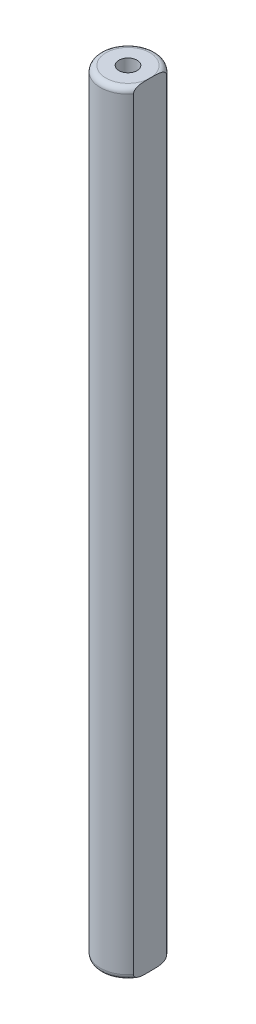
ISO-10303-21;
HEADER;
FILE_DESCRIPTION(('STEP AP214'),'2;1');
FILE_NAME('part.step','',(''),(''),'','','');
FILE_SCHEMA(('AUTOMOTIVE_DESIGN { 1 0 10303 214 1 1 1 1 }'));
ENDSEC;
DATA;
#1=APPLICATION_CONTEXT('core data for automotive mechanical design processes');
#2=APPLICATION_PROTOCOL_DEFINITION('international standard','automotive_design',2000,#1);
#3=PRODUCT_CONTEXT('',#1,'mechanical');
#4=PRODUCT('Part','Part','',(#3));
#5=PRODUCT_RELATED_PRODUCT_CATEGORY('part','',(#4));
#6=PRODUCT_DEFINITION_FORMATION('','',#4);
#7=PRODUCT_DEFINITION_CONTEXT('part definition',#1,'design');
#8=PRODUCT_DEFINITION('design','',#6,#7);
#9=PRODUCT_DEFINITION_SHAPE('','',#8);
#10=(LENGTH_UNIT() NAMED_UNIT(*) SI_UNIT(.MILLI.,.METRE.));
#11=(NAMED_UNIT(*) PLANE_ANGLE_UNIT() SI_UNIT($,.RADIAN.));
#12=(NAMED_UNIT(*) SI_UNIT($,.STERADIAN.) SOLID_ANGLE_UNIT());
#13=UNCERTAINTY_MEASURE_WITH_UNIT(LENGTH_MEASURE(1.E-05),#10,'distance_accuracy_value','');
#14=(GEOMETRIC_REPRESENTATION_CONTEXT(3) GLOBAL_UNCERTAINTY_ASSIGNED_CONTEXT((#13)) GLOBAL_UNIT_ASSIGNED_CONTEXT((#10,
#11,#12)) REPRESENTATION_CONTEXT('',''));
#15=CARTESIAN_POINT('',(0.,0.,0.));
#16=DIRECTION('',(0.,0.,1.));
#17=DIRECTION('',(1.,0.,0.));
#18=AXIS2_PLACEMENT_3D('',#15,#16,#17);
#19=CARTESIAN_POINT('',(0.,-35.15,0.));
#20=DIRECTION('',(0.,-1.,0.));
#21=DIRECTION('',(0.,0.,1.));
#22=AXIS2_PLACEMENT_3D('',#19,#20,#21);
#23=PLANE('',#22);
#24=CARTESIAN_POINT('',(0.,-35.15,0.));
#25=DIRECTION('',(0.,-1.,0.));
#26=DIRECTION('',(0.,0.,-1.));
#27=AXIS2_PLACEMENT_3D('',#24,#25,#26);
#28=CIRCLE('',#27,2.);
#29=CARTESIAN_POINT('',(2.,-35.15,0.));
#30=VERTEX_POINT('',#29);
#31=EDGE_CURVE('E11',#30,#30,#28,.T.);
#32=ORIENTED_EDGE('',*,*,#31,.T.);
#33=EDGE_LOOP('',(#32));
#34=FACE_BOUND('',#33,.T.);
#35=CARTESIAN_POINT('',(0.,-35.15,0.));
#36=DIRECTION('',(0.,1.,0.));
#37=DIRECTION('',(0.,0.,1.));
#38=AXIS2_PLACEMENT_3D('',#35,#36,#37);
#39=CIRCLE('',#38,0.825);
#40=CARTESIAN_POINT('',(0.,-35.15,0.825));
#41=VERTEX_POINT('',#40);
#42=EDGE_CURVE('E152',#41,#41,#39,.T.);
#43=ORIENTED_EDGE('',*,*,#42,.T.);
#44=EDGE_LOOP('',(#43));
#45=FACE_BOUND('',#44,.T.);
#46=ADVANCED_FACE('F38',(#34,#45),#23,.T.);
#47=CARTESIAN_POINT('',(0.,35.15,0.));
#48=DIRECTION('',(0.,-1.,0.));
#49=DIRECTION('',(0.,0.,-1.));
#50=AXIS2_PLACEMENT_3D('',#47,#48,#49);
#51=CYLINDRICAL_SURFACE('',#50,2.5);
#52=DIRECTION('',(0.,1.,0.));
#53=VECTOR('',#52,1.);
#54=CARTESIAN_POINT('',(2.,0.,-1.5));
#55=LINE('',#54,#53);
#56=CARTESIAN_POINT('',(2.,-34.65,-1.5));
#57=VERTEX_POINT('',#56);
#58=CARTESIAN_POINT('',(2.,34.65,-1.5));
#59=VERTEX_POINT('',#58);
#60=EDGE_CURVE('E89',#57,#59,#55,.T.);
#61=ORIENTED_EDGE('',*,*,#60,.F.);
#62=CARTESIAN_POINT('',(0.,-34.65,0.));
#63=DIRECTION('',(0.,-1.,0.));
#64=DIRECTION('',(0.,0.,-1.));
#65=AXIS2_PLACEMENT_3D('',#62,#63,#64);
#66=CIRCLE('',#65,2.5);
#67=CARTESIAN_POINT('',(2.,-34.65,1.5));
#68=VERTEX_POINT('',#67);
#69=EDGE_CURVE('E129',#57,#68,#66,.F.);
#70=ORIENTED_EDGE('',*,*,#69,.T.);
#71=DIRECTION('',(0.,1.,0.));
#72=VECTOR('',#71,1.);
#73=CARTESIAN_POINT('',(2.,0.,1.5));
#74=LINE('',#73,#72);
#75=CARTESIAN_POINT('',(2.,34.65,1.5));
#76=VERTEX_POINT('',#75);
#77=EDGE_CURVE('E137',#68,#76,#74,.T.);
#78=ORIENTED_EDGE('',*,*,#77,.T.);
#79=CARTESIAN_POINT('',(0.,34.65,0.));
#80=DIRECTION('',(0.,1.,0.));
#81=DIRECTION('',(0.,0.,1.));
#82=AXIS2_PLACEMENT_3D('',#79,#80,#81);
#83=CIRCLE('',#82,2.5);
#84=EDGE_CURVE('E84',#76,#59,#83,.F.);
#85=ORIENTED_EDGE('',*,*,#84,.T.);
#86=EDGE_LOOP('',(#61,#70,#78,#85));
#87=FACE_BOUND('',#86,.T.);
#88=ADVANCED_FACE('F172',(#87),#51,.T.);
#89=CARTESIAN_POINT('',(0.,35.15,0.));
#90=DIRECTION('',(0.,1.,0.));
#91=DIRECTION('',(0.,0.,1.));
#92=AXIS2_PLACEMENT_3D('',#89,#90,#91);
#93=PLANE('',#92);
#94=CARTESIAN_POINT('',(0.,35.15,0.));
#95=DIRECTION('',(0.,1.,0.));
#96=DIRECTION('',(0.,0.,1.));
#97=AXIS2_PLACEMENT_3D('',#94,#95,#96);
#98=CIRCLE('',#97,2.);
#99=CARTESIAN_POINT('',(2.,35.15,0.));
#100=VERTEX_POINT('',#99);
#101=EDGE_CURVE('E82',#100,#100,#98,.T.);
#102=ORIENTED_EDGE('',*,*,#101,.T.);
#103=EDGE_LOOP('',(#102));
#104=FACE_BOUND('',#103,.T.);
#105=CARTESIAN_POINT('',(0.,35.15,0.));
#106=DIRECTION('',(0.,1.,0.));
#107=DIRECTION('',(0.,0.,1.));
#108=AXIS2_PLACEMENT_3D('',#105,#106,#107);
#109=CIRCLE('',#108,0.825);
#110=CARTESIAN_POINT('',(0.,35.15,0.825));
#111=VERTEX_POINT('',#110);
#112=EDGE_CURVE('E97',#111,#111,#109,.T.);
#113=ORIENTED_EDGE('',*,*,#112,.F.);
#114=EDGE_LOOP('',(#113));
#115=FACE_BOUND('',#114,.T.);
#116=ADVANCED_FACE('F92',(#104,#115),#93,.T.);
#117=CARTESIAN_POINT('',(0.,30.15,0.));
#118=DIRECTION('',(0.,1.,0.));
#119=DIRECTION('',(0.,0.,1.));
#120=AXIS2_PLACEMENT_3D('',#117,#118,#119);
#121=CYLINDRICAL_SURFACE('',#120,0.825);
#122=CARTESIAN_POINT('',(0.,30.15,0.));
#123=DIRECTION('',(0.,1.,0.));
#124=DIRECTION('',(0.,0.,1.));
#125=AXIS2_PLACEMENT_3D('',#122,#123,#124);
#126=CIRCLE('',#125,0.825);
#127=CARTESIAN_POINT('',(0.,30.15,0.825));
#128=VERTEX_POINT('',#127);
#129=EDGE_CURVE('E94',#128,#128,#126,.T.);
#130=ORIENTED_EDGE('',*,*,#129,.F.);
#131=EDGE_LOOP('',(#130));
#132=FACE_BOUND('',#131,.T.);
#133=ORIENTED_EDGE('',*,*,#112,.T.);
#134=EDGE_LOOP('',(#133));
#135=FACE_BOUND('',#134,.T.);
#136=ADVANCED_FACE('F179',(#132,#135),#121,.F.);
#137=CARTESIAN_POINT('',(0.,30.15,0.));
#138=DIRECTION('',(0.,1.,0.));
#139=DIRECTION('',(0.,0.,1.));
#140=AXIS2_PLACEMENT_3D('',#137,#138,#139);
#141=PLANE('',#140);
#142=ORIENTED_EDGE('',*,*,#129,.T.);
#143=EDGE_LOOP('',(#142));
#144=FACE_BOUND('',#143,.T.);
#145=ADVANCED_FACE('F116',(#144),#141,.T.);
#146=CARTESIAN_POINT('',(2.,0.,-1.5));
#147=DIRECTION('',(-1.,0.,0.));
#148=DIRECTION('',(0.,0.,1.));
#149=AXIS2_PLACEMENT_3D('',#146,#147,#148);
#150=PLANE('',#149);
#151=ORIENTED_EDGE('',*,*,#77,.F.);
#152=CARTESIAN_POINT('',(2.,-34.65,1.5));
#153=CARTESIAN_POINT('',(2.,-34.6700065150284,1.50005508764518));
#154=CARTESIAN_POINT('',(2.,-34.6899505223803,1.49800297503595));
#155=CARTESIAN_POINT('',(2.,-34.7288908622129,1.49017103135305));
#156=CARTESIAN_POINT('',(2.,-34.747894786355,1.48442943896435));
#157=CARTESIAN_POINT('',(2.,-34.7845007170815,1.46971395516313));
#158=CARTESIAN_POINT('',(2.,-34.8021074472318,1.46075157527048));
#159=CARTESIAN_POINT('',(2.,-34.8357418270518,1.44018960181345));
#160=CARTESIAN_POINT('',(2.,-34.8517650844176,1.42858295243752));
#161=CARTESIAN_POINT('',(2.,-34.8889337995344,1.39760924057377));
#162=CARTESIAN_POINT('',(2.,-34.9091275913188,1.37710380043444));
#163=CARTESIAN_POINT('',(2.,-34.9460193785026,1.33321537886329));
#164=CARTESIAN_POINT('',(2.,-34.9627135559447,1.30982929844171));
#165=CARTESIAN_POINT('',(2.,-35.0025266059827,1.24588475655889));
#166=CARTESIAN_POINT('',(2.,-35.0231102761167,1.20375339504332));
#167=CARTESIAN_POINT('',(2.,-35.0492657628372,1.13857481760511));
#168=CARTESIAN_POINT('',(2.,-35.0572271665565,1.11639476146753));
#169=CARTESIAN_POINT('',(2.,-35.0717347834849,1.07158652733003));
#170=CARTESIAN_POINT('',(2.,-35.0782820228324,1.04895868735181));
#171=CARTESIAN_POINT('',(2.,-35.0954775535542,0.98298944776737));
#172=CARTESIAN_POINT('',(2.,-35.1045494991958,0.939240813702859));
#173=CARTESIAN_POINT('',(2.,-35.1194389319571,0.851180575194735));
#174=CARTESIAN_POINT('',(2.,-35.1252529100803,0.806868416119301));
#175=CARTESIAN_POINT('',(2.,-35.1345404183726,0.717748873858477));
#176=CARTESIAN_POINT('',(2.,-35.1380000262617,0.672940110398204));
#177=CARTESIAN_POINT('',(2.,-35.143276064899,0.583224127429965));
#178=CARTESIAN_POINT('',(2.,-35.1450920982067,0.538316886738996));
#179=CARTESIAN_POINT('',(2.,-35.1475884411658,0.452027170138225));
#180=CARTESIAN_POINT('',(2.,-35.148347176557,0.41064666147799));
#181=CARTESIAN_POINT('',(2.,-35.1493649293624,0.327877214900425));
#182=CARTESIAN_POINT('',(2.,-35.1496239046374,0.286488276566558));
#183=CARTESIAN_POINT('',(2.,-35.1499262759537,0.204245986253938));
#184=CARTESIAN_POINT('',(2.,-35.1499724201265,0.163392638975671));
#185=CARTESIAN_POINT('',(2.,-35.1499994454164,0.0816928216893207));
#186=CARTESIAN_POINT('',(2.,-35.1499803376138,0.0408463516913591));
#187=CARTESIAN_POINT('',(2.,-35.15,0.));
#188=B_SPLINE_CURVE_WITH_KNOTS('',3,(#152,#153,#154,#155,#156,#157,#158,#159,#160,#161,#162,
#163,#164,#165,#166,#167,#168,#169,#170,#171,#172,#173,#174,#175,#176,#177,#178,#179,#180,#181,
#182,#183,#184,#185,#186,#187),.UNSPECIFIED.,.F.,.F.,(4,2,2,2,2,2,2,2,2,2,2,2,2,2,2,2,2,4),(0.,
0.0598154823382621,0.119020807803601,0.17801659652445,0.237171689151991,0.323022405322572,
0.408966299732605,0.548800102010776,0.619474466309546,0.690097374684539,0.823948961414452,
0.957944437366622,1.09272554990604,1.22753924580545,1.35169671337952,1.47586464927865,
1.59842472260638,1.72096398530663),.UNSPECIFIED.);
#189=EDGE_CURVE('E48',#68,#30,#188,.T.);
#190=ORIENTED_EDGE('',*,*,#189,.T.);
#191=CARTESIAN_POINT('',(2.,-35.15,0.));
#192=CARTESIAN_POINT('',(2.,-35.149980484284,-0.0407626231076274));
#193=CARTESIAN_POINT('',(2.,-35.1499994433899,-0.0815253750922536));
#194=CARTESIAN_POINT('',(2.,-35.1499726519699,-0.163057529759016));
#195=CARTESIAN_POINT('',(2.,-35.1499268907924,-0.203826932431483));
#196=CARTESIAN_POINT('',(2.,-35.1496272394696,-0.285823216792322));
#197=CARTESIAN_POINT('',(2.,-35.149371017725,-0.327050094240998));
#198=CARTESIAN_POINT('',(2.,-35.1483653267444,-0.409495794992681));
#199=CARTESIAN_POINT('',(2.,-35.1476158970779,-0.450714618676486));
#200=CARTESIAN_POINT('',(2.,-35.1452076449429,-0.534687159846427));
#201=CARTESIAN_POINT('',(2.,-35.1435155371863,-0.577440036322866));
#202=CARTESIAN_POINT('',(2.,-35.1386762279352,-0.662861842446356));
#203=CARTESIAN_POINT('',(2.,-35.1355293281928,-0.705530787660105));
#204=CARTESIAN_POINT('',(2.,-35.1271629448661,-0.790467964812877));
#205=CARTESIAN_POINT('',(2.,-35.1219534285849,-0.832737137282495));
#206=CARTESIAN_POINT('',(2.,-35.1087065375739,-0.916821134882459));
#207=CARTESIAN_POINT('',(2.,-35.1006717348777,-0.958636337716525));
#208=CARTESIAN_POINT('',(2.,-35.0868499282799,-1.01633423815903));
#209=CARTESIAN_POINT('',(2.,-35.0826447414506,-1.0325980627166));
#210=CARTESIAN_POINT('',(2.,-35.0735803939948,-1.06494846149723));
#211=CARTESIAN_POINT('',(2.,-35.0687209867408,-1.08103496638818));
#212=CARTESIAN_POINT('',(2.,-35.0530766101654,-1.12889043811801));
#213=CARTESIAN_POINT('',(2.,-35.0412104355907,-1.16032087149607));
#214=CARTESIAN_POINT('',(2.,-35.0138471087185,-1.22193787642586));
#215=CARTESIAN_POINT('',(2.,-34.9983172442343,-1.25211017751242));
#216=CARTESIAN_POINT('',(2.,-34.9629711649222,-1.30987180248265));
#217=CARTESIAN_POINT('',(2.,-34.9431618343013,-1.33746517402656));
#218=CARTESIAN_POINT('',(2.,-34.9063229296638,-1.37963467843694));
#219=CARTESIAN_POINT('',(2.,-34.8906851186369,-1.39542133682361));
#220=CARTESIAN_POINT('',(2.,-34.8572261082969,-1.4245077100884));
#221=CARTESIAN_POINT('',(2.,-34.8394069701865,-1.437809743192));
#222=CARTESIAN_POINT('',(2.,-34.8045634610992,-1.45935751669132));
#223=CARTESIAN_POINT('',(2.,-34.787825568107,-1.46806350146972));
#224=CARTESIAN_POINT('',(2.,-34.7531430315798,-1.48256312102217));
#225=CARTESIAN_POINT('',(2.,-34.7352009877708,-1.48836281472544));
#226=CARTESIAN_POINT('',(2.,-34.7059337018008,-1.49497096281989));
#227=CARTESIAN_POINT('',(2.,-34.6948421897842,-1.49684839330713));
#228=CARTESIAN_POINT('',(2.,-34.6725033908703,-1.49936626406292));
#229=CARTESIAN_POINT('',(2.,-34.6612558958349,-1.50000485038369));
#230=CARTESIAN_POINT('',(2.,-34.65,-1.5));
#231=B_SPLINE_CURVE_WITH_KNOTS('',3,(#191,#192,#193,#194,#195,#196,#197,#198,#199,#200,#201,
#202,#203,#204,#205,#206,#207,#208,#209,#210,#211,#212,#213,#214,#215,#216,#217,#218,#219,#220,
#221,#222,#223,#224,#225,#226,#227,#228,#229,#230),.UNSPECIFIED.,.F.,.F.,(4,2,2,2,2,2,2,2,2,2,2,
2,2,2,2,2,2,2,2,4),(0.,0.12228809850213,0.244596325308742,0.368278121933785,0.491949996900834,
0.620293921253732,0.748611236515076,0.876315899810977,1.00390460532892,1.05428854590095,
1.10469153363842,1.20529649885782,1.30683621704436,1.40821379274342,1.47468160162246,
1.54108708094665,1.5974625296124,1.65371995469662,1.68740390926937,1.72113823358775),.UNSPECIFIED.);
#232=EDGE_CURVE('E61',#30,#57,#231,.T.);
#233=ORIENTED_EDGE('',*,*,#232,.T.);
#234=ORIENTED_EDGE('',*,*,#60,.T.);
#235=CARTESIAN_POINT('',(2.,34.65,-1.5));
#236=CARTESIAN_POINT('',(2.,34.6700065150284,-1.50005508764519));
#237=CARTESIAN_POINT('',(2.,34.6899505223803,-1.49800297503596));
#238=CARTESIAN_POINT('',(2.,34.7288908622129,-1.49017103135305));
#239=CARTESIAN_POINT('',(2.,34.747894786355,-1.48442943896435));
#240=CARTESIAN_POINT('',(2.,34.7845007170815,-1.46971395516313));
#241=CARTESIAN_POINT('',(2.,34.8021074472318,-1.4607515752705));
#242=CARTESIAN_POINT('',(2.,34.8357418270518,-1.44018960181346));
#243=CARTESIAN_POINT('',(2.,34.8517650844175,-1.42858295243752));
#244=CARTESIAN_POINT('',(2.,34.8889337995344,-1.39760924057377));
#245=CARTESIAN_POINT('',(2.,34.9091275913187,-1.37710380043445));
#246=CARTESIAN_POINT('',(2.,34.9460193785026,-1.33321537886332));
#247=CARTESIAN_POINT('',(2.,34.9627135559447,-1.30982929844172));
#248=CARTESIAN_POINT('',(2.,35.0025266059826,-1.24588475655888));
#249=CARTESIAN_POINT('',(2.,35.0231102761167,-1.20375339504333));
#250=CARTESIAN_POINT('',(2.,35.0492657628372,-1.13857481760513));
#251=CARTESIAN_POINT('',(2.,35.0572271665565,-1.11639476146755));
#252=CARTESIAN_POINT('',(2.,35.0717347834849,-1.07158652733005));
#253=CARTESIAN_POINT('',(2.,35.0782820228323,-1.04895868735181));
#254=CARTESIAN_POINT('',(2.,35.0954775535541,-0.982989447767362));
#255=CARTESIAN_POINT('',(2.,35.1045494991958,-0.939240813702856));
#256=CARTESIAN_POINT('',(2.,35.1194389319571,-0.851180575194732));
#257=CARTESIAN_POINT('',(2.,35.1252529100803,-0.806868416119293));
#258=CARTESIAN_POINT('',(2.,35.1345404183726,-0.717748873858465));
#259=CARTESIAN_POINT('',(2.,35.1380000262617,-0.672940110398194));
#260=CARTESIAN_POINT('',(2.,35.143276064899,-0.583224127429958));
#261=CARTESIAN_POINT('',(2.,35.1450920982067,-0.53831688673899));
#262=CARTESIAN_POINT('',(2.,35.1475884411658,-0.452027170138223));
#263=CARTESIAN_POINT('',(2.,35.148347176557,-0.41064666147799));
#264=CARTESIAN_POINT('',(2.,35.1493649293624,-0.327877214900431));
#265=CARTESIAN_POINT('',(2.,35.1496239046375,-0.286488276566567));
#266=CARTESIAN_POINT('',(2.,35.1499262759538,-0.204245986253948));
#267=CARTESIAN_POINT('',(2.,35.1499724201265,-0.163392638975679));
#268=CARTESIAN_POINT('',(2.,35.1499994454164,-0.0816928216893252));
#269=CARTESIAN_POINT('',(2.,35.1499803376138,-0.0408463516913614));
#270=CARTESIAN_POINT('',(2.,35.15,0.));
#271=B_SPLINE_CURVE_WITH_KNOTS('',3,(#235,#236,#237,#238,#239,#240,#241,#242,#243,#244,#245,
#246,#247,#248,#249,#250,#251,#252,#253,#254,#255,#256,#257,#258,#259,#260,#261,#262,#263,#264,
#265,#266,#267,#268,#269,#270),.UNSPECIFIED.,.F.,.F.,(4,2,2,2,2,2,2,2,2,2,2,2,2,2,2,2,2,4),(0.,
0.0598154823382616,0.119020807803602,0.178016596524458,0.237171689151983,0.323022405322564,
0.408966299732602,0.548800102010775,0.619474466309544,0.690097374684543,0.823948961414469,
0.957944437366646,1.09272554990606,1.22753924580546,1.35169671337953,1.47586464927865,
1.59842472260638,1.72096398530664),.UNSPECIFIED.);
#272=EDGE_CURVE('E86',#59,#100,#271,.T.);
#273=ORIENTED_EDGE('',*,*,#272,.T.);
#274=CARTESIAN_POINT('',(2.,35.15,0.));
#275=CARTESIAN_POINT('',(2.,35.149980484284,0.0407626231076324));
#276=CARTESIAN_POINT('',(2.,35.1499994433899,0.0815253750922637));
#277=CARTESIAN_POINT('',(2.,35.1499726519699,0.163057529759035));
#278=CARTESIAN_POINT('',(2.,35.1499268907924,0.203826932431507));
#279=CARTESIAN_POINT('',(2.,35.1496272394696,0.28582321679235));
#280=CARTESIAN_POINT('',(2.,35.1493710177251,0.327050094241024));
#281=CARTESIAN_POINT('',(2.,35.1483653267444,0.409495794992707));
#282=CARTESIAN_POINT('',(2.,35.1476158970779,0.450714618676512));
#283=CARTESIAN_POINT('',(2.,35.1452076449429,0.534687159846449));
#284=CARTESIAN_POINT('',(2.,35.1435155371863,0.577440036322884));
#285=CARTESIAN_POINT('',(2.,35.1386762279352,0.662861842446366));
#286=CARTESIAN_POINT('',(2.,35.1355293281928,0.705530787660111));
#287=CARTESIAN_POINT('',(2.,35.1271629448661,0.790467964812881));
#288=CARTESIAN_POINT('',(2.,35.121953428585,0.832737137282501));
#289=CARTESIAN_POINT('',(2.,35.1087065375739,0.916821134882458));
#290=CARTESIAN_POINT('',(2.,35.1006717348776,0.958636337716515));
#291=CARTESIAN_POINT('',(2.,35.0868499282799,1.01633423815903));
#292=CARTESIAN_POINT('',(2.,35.0826447414506,1.03259806271661));
#293=CARTESIAN_POINT('',(2.,35.0735803939948,1.06494846149725));
#294=CARTESIAN_POINT('',(2.,35.0687209867408,1.08103496638819));
#295=CARTESIAN_POINT('',(2.,35.0530766101654,1.12889043811802));
#296=CARTESIAN_POINT('',(2.,35.0412104355906,1.16032087149606));
#297=CARTESIAN_POINT('',(2.,35.0138471087185,1.22193787642586));
#298=CARTESIAN_POINT('',(2.,34.9983172442343,1.25211017751243));
#299=CARTESIAN_POINT('',(2.,34.9629711649222,1.30987180248266));
#300=CARTESIAN_POINT('',(2.,34.9431618343012,1.33746517402655));
#301=CARTESIAN_POINT('',(2.,34.9063229296638,1.37963467843694));
#302=CARTESIAN_POINT('',(2.,34.8906851186369,1.39542133682363));
#303=CARTESIAN_POINT('',(2.,34.8572261082969,1.42450771008842));
#304=CARTESIAN_POINT('',(2.,34.8394069701865,1.43780974319199));
#305=CARTESIAN_POINT('',(2.,34.8045634610992,1.45935751669132));
#306=CARTESIAN_POINT('',(2.,34.787825568107,1.46806350146973));
#307=CARTESIAN_POINT('',(2.,34.7531430315798,1.48256312102218));
#308=CARTESIAN_POINT('',(2.,34.7352009877707,1.48836281472544));
#309=CARTESIAN_POINT('',(2.,34.7059337018007,1.49497096281989));
#310=CARTESIAN_POINT('',(2.,34.6948421897841,1.49684839330713));
#311=CARTESIAN_POINT('',(2.,34.6725033908703,1.49936626406293));
#312=CARTESIAN_POINT('',(2.,34.6612558958349,1.5000048503837));
#313=CARTESIAN_POINT('',(2.,34.65,1.5));
#314=B_SPLINE_CURVE_WITH_KNOTS('',3,(#274,#275,#276,#277,#278,#279,#280,#281,#282,#283,#284,
#285,#286,#287,#288,#289,#290,#291,#292,#293,#294,#295,#296,#297,#298,#299,#300,#301,#302,#303,
#304,#305,#306,#307,#308,#309,#310,#311,#312,#313),.UNSPECIFIED.,.F.,.F.,(4,2,2,2,2,2,2,2,2,2,2,
2,2,2,2,2,2,2,2,4),(0.,0.122288098502145,0.24459632530877,0.368278121933812,0.491949996900859,
0.620293921253746,0.74861123651508,0.876315899810978,1.00390460532893,1.05428854590096,
1.10469153363843,1.20529649885783,1.30683621704437,1.40821379274343,1.47468160162247,
1.54108708094667,1.59746252961242,1.65371995469665,1.68740390926938,1.72113823358776),.UNSPECIFIED.);
#315=EDGE_CURVE('E77',#100,#76,#314,.T.);
#316=ORIENTED_EDGE('',*,*,#315,.T.);
#317=EDGE_LOOP('',(#151,#190,#233,#234,#273,#316));
#318=FACE_BOUND('',#317,.T.);
#319=ADVANCED_FACE('F88',(#318),#150,.F.);
#320=CARTESIAN_POINT('',(0.,34.65,0.));
#321=DIRECTION('',(0.,1.,0.));
#322=DIRECTION('',(0.,0.,1.));
#323=AXIS2_PLACEMENT_3D('',#320,#321,#322);
#324=TOROIDAL_SURFACE('',#323,2.,0.5);
#325=ORIENTED_EDGE('',*,*,#272,.F.);
#326=ORIENTED_EDGE('',*,*,#84,.F.);
#327=ORIENTED_EDGE('',*,*,#315,.F.);
#328=ORIENTED_EDGE('',*,*,#101,.F.);
#329=EDGE_LOOP('',(#325,#326,#327,#328));
#330=FACE_BOUND('',#329,.T.);
#331=ADVANCED_FACE('F80',(#330),#324,.T.);
#332=CARTESIAN_POINT('',(0.,-30.15,0.));
#333=DIRECTION('',(0.,-1.,0.));
#334=DIRECTION('',(0.,0.,-1.));
#335=AXIS2_PLACEMENT_3D('',#332,#333,#334);
#336=CYLINDRICAL_SURFACE('',#335,0.825);
#337=CARTESIAN_POINT('',(0.,-30.15,0.));
#338=DIRECTION('',(0.,1.,0.));
#339=DIRECTION('',(0.,0.,1.));
#340=AXIS2_PLACEMENT_3D('',#337,#338,#339);
#341=CIRCLE('',#340,0.825);
#342=CARTESIAN_POINT('',(0.,-30.15,0.825));
#343=VERTEX_POINT('',#342);
#344=EDGE_CURVE('E149',#343,#343,#341,.T.);
#345=ORIENTED_EDGE('',*,*,#344,.T.);
#346=EDGE_LOOP('',(#345));
#347=FACE_BOUND('',#346,.T.);
#348=ORIENTED_EDGE('',*,*,#42,.F.);
#349=EDGE_LOOP('',(#348));
#350=FACE_BOUND('',#349,.T.);
#351=ADVANCED_FACE('F162',(#347,#350),#336,.F.);
#352=CARTESIAN_POINT('',(0.,-30.15,0.));
#353=DIRECTION('',(0.,-1.,0.));
#354=DIRECTION('',(0.,0.,1.));
#355=AXIS2_PLACEMENT_3D('',#352,#353,#354);
#356=PLANE('',#355);
#357=ORIENTED_EDGE('',*,*,#344,.F.);
#358=EDGE_LOOP('',(#357));
#359=FACE_BOUND('',#358,.T.);
#360=ADVANCED_FACE('F164',(#359),#356,.T.);
#361=CARTESIAN_POINT('',(0.,-34.65,0.));
#362=DIRECTION('',(0.,-1.,0.));
#363=DIRECTION('',(0.,0.,-1.));
#364=AXIS2_PLACEMENT_3D('',#361,#362,#363);
#365=TOROIDAL_SURFACE('',#364,2.,0.5);
#366=ORIENTED_EDGE('',*,*,#232,.F.);
#367=ORIENTED_EDGE('',*,*,#31,.F.);
#368=ORIENTED_EDGE('',*,*,#189,.F.);
#369=ORIENTED_EDGE('',*,*,#69,.F.);
#370=EDGE_LOOP('',(#366,#367,#368,#369));
#371=FACE_BOUND('',#370,.T.);
#372=ADVANCED_FACE('F40',(#371),#365,.T.);
#373=CLOSED_SHELL('',(#46,#88,#116,#136,#145,#319,#331,#351,#360,#372));
#374=MANIFOLD_SOLID_BREP('B2',#373);
#375=ADVANCED_BREP_SHAPE_REPRESENTATION('',(#18,#374),#14);
#376=SHAPE_DEFINITION_REPRESENTATION(#9,#375);
ENDSEC;
END-ISO-10303-21;
